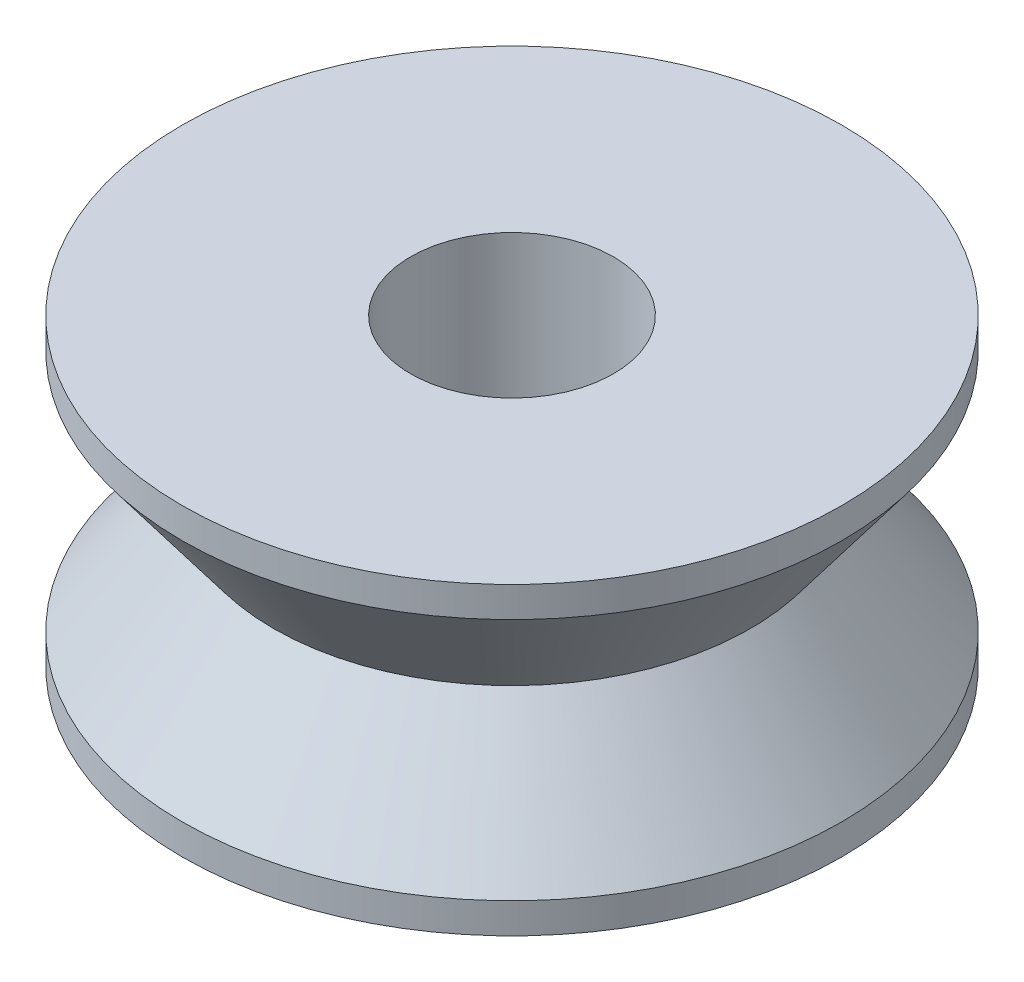
ISO-10303-21;
HEADER;
FILE_DESCRIPTION(('STEP AP214'),'2;1');
FILE_NAME('part.step','',(''),(''),'','','');
FILE_SCHEMA(('AUTOMOTIVE_DESIGN { 1 0 10303 214 1 1 1 1 }'));
ENDSEC;
DATA;
#1=APPLICATION_CONTEXT('core data for automotive mechanical design processes');
#2=APPLICATION_PROTOCOL_DEFINITION('international standard','automotive_design',2000,#1);
#3=PRODUCT_CONTEXT('',#1,'mechanical');
#4=PRODUCT('Part','Part','',(#3));
#5=PRODUCT_RELATED_PRODUCT_CATEGORY('part','',(#4));
#6=PRODUCT_DEFINITION_FORMATION('','',#4);
#7=PRODUCT_DEFINITION_CONTEXT('part definition',#1,'design');
#8=PRODUCT_DEFINITION('design','',#6,#7);
#9=PRODUCT_DEFINITION_SHAPE('','',#8);
#10=(LENGTH_UNIT() NAMED_UNIT(*) SI_UNIT(.MILLI.,.METRE.));
#11=(NAMED_UNIT(*) PLANE_ANGLE_UNIT() SI_UNIT($,.RADIAN.));
#12=(NAMED_UNIT(*) SI_UNIT($,.STERADIAN.) SOLID_ANGLE_UNIT());
#13=UNCERTAINTY_MEASURE_WITH_UNIT(LENGTH_MEASURE(1.E-05),#10,'distance_accuracy_value','');
#14=(GEOMETRIC_REPRESENTATION_CONTEXT(3) GLOBAL_UNCERTAINTY_ASSIGNED_CONTEXT((#13)) GLOBAL_UNIT_ASSIGNED_CONTEXT((#10,
#11,#12)) REPRESENTATION_CONTEXT('',''));
#15=CARTESIAN_POINT('',(0.,0.,0.));
#16=DIRECTION('',(0.,0.,1.));
#17=DIRECTION('',(1.,0.,0.));
#18=AXIS2_PLACEMENT_3D('',#15,#16,#17);
#19=CARTESIAN_POINT('',(-2.,3.,0.));
#20=DIRECTION('',(0.,-1.,0.));
#21=DIRECTION('',(0.,0.,-1.));
#22=AXIS2_PLACEMENT_3D('',#19,#20,#21);
#23=PLANE('',#22);
#24=CARTESIAN_POINT('',(0.,3.,0.));
#25=DIRECTION('',(0.,-1.,0.));
#26=DIRECTION('',(0.,0.,-1.));
#27=AXIS2_PLACEMENT_3D('',#24,#25,#26);
#28=CIRCLE('',#27,6.5);
#29=CARTESIAN_POINT('',(0.,3.,-6.5));
#30=VERTEX_POINT('',#29);
#31=EDGE_CURVE('E10',#30,#30,#28,.T.);
#32=ORIENTED_EDGE('',*,*,#31,.F.);
#33=EDGE_LOOP('',(#32));
#34=FACE_BOUND('',#33,.T.);
#35=CARTESIAN_POINT('',(0.,3.,0.));
#36=DIRECTION('',(0.,-1.,0.));
#37=DIRECTION('',(0.,0.,-1.));
#38=AXIS2_PLACEMENT_3D('',#35,#36,#37);
#39=CIRCLE('',#38,2.);
#40=CARTESIAN_POINT('',(0.,3.,-2.));
#41=VERTEX_POINT('',#40);
#42=EDGE_CURVE('E62',#41,#41,#39,.T.);
#43=ORIENTED_EDGE('',*,*,#42,.T.);
#44=EDGE_LOOP('',(#43));
#45=FACE_BOUND('',#44,.T.);
#46=ADVANCED_FACE('F37',(#34,#45),#23,.F.);
#47=CARTESIAN_POINT('',(0.,0.,0.));
#48=DIRECTION('',(0.,-1.,0.));
#49=DIRECTION('',(0.,0.,-1.));
#50=AXIS2_PLACEMENT_3D('',#47,#48,#49);
#51=CYLINDRICAL_SURFACE('',#50,6.5);
#52=CARTESIAN_POINT('',(0.,2.4,0.));
#53=DIRECTION('',(0.,-1.,0.));
#54=DIRECTION('',(0.,0.,-1.));
#55=AXIS2_PLACEMENT_3D('',#52,#53,#54);
#56=CIRCLE('',#55,6.5);
#57=CARTESIAN_POINT('',(0.,2.4,-6.5));
#58=VERTEX_POINT('',#57);
#59=EDGE_CURVE('E43',#58,#58,#56,.T.);
#60=ORIENTED_EDGE('',*,*,#59,.F.);
#61=EDGE_LOOP('',(#60));
#62=FACE_BOUND('',#61,.T.);
#63=ORIENTED_EDGE('',*,*,#31,.T.);
#64=EDGE_LOOP('',(#63));
#65=FACE_BOUND('',#64,.T.);
#66=ADVANCED_FACE('F93',(#62,#65),#51,.T.);
#67=CARTESIAN_POINT('',(0.,2.4,0.));
#68=DIRECTION('',(0.,1.,0.));
#69=DIRECTION('',(0.,0.,1.));
#70=AXIS2_PLACEMENT_3D('',#67,#68,#69);
#71=CONICAL_SURFACE('',#70,6.5,0.643501108793285);
#72=CARTESIAN_POINT('',(0.,0.,0.));
#73=DIRECTION('',(0.,-1.,0.));
#74=DIRECTION('',(0.,0.,-1.));
#75=AXIS2_PLACEMENT_3D('',#72,#73,#74);
#76=CIRCLE('',#75,4.7);
#77=CARTESIAN_POINT('',(0.,0.,-4.7));
#78=VERTEX_POINT('',#77);
#79=EDGE_CURVE('E47',#78,#78,#76,.T.);
#80=ORIENTED_EDGE('',*,*,#79,.F.);
#81=EDGE_LOOP('',(#80));
#82=FACE_BOUND('',#81,.T.);
#83=ORIENTED_EDGE('',*,*,#59,.T.);
#84=EDGE_LOOP('',(#83));
#85=FACE_BOUND('',#84,.T.);
#86=ADVANCED_FACE('F88',(#82,#85),#71,.T.);
#87=CARTESIAN_POINT('',(0.,0.,0.));
#88=DIRECTION('',(0.,-1.,0.));
#89=DIRECTION('',(0.,0.,-1.));
#90=AXIS2_PLACEMENT_3D('',#87,#88,#89);
#91=CONICAL_SURFACE('',#90,4.7,0.643501108793285);
#92=CARTESIAN_POINT('',(0.,-2.4,0.));
#93=DIRECTION('',(0.,-1.,0.));
#94=DIRECTION('',(0.,0.,-1.));
#95=AXIS2_PLACEMENT_3D('',#92,#93,#94);
#96=CIRCLE('',#95,6.5);
#97=CARTESIAN_POINT('',(0.,-2.4,-6.5));
#98=VERTEX_POINT('',#97);
#99=EDGE_CURVE('E51',#98,#98,#96,.T.);
#100=ORIENTED_EDGE('',*,*,#99,.F.);
#101=EDGE_LOOP('',(#100));
#102=FACE_BOUND('',#101,.T.);
#103=ORIENTED_EDGE('',*,*,#79,.T.);
#104=EDGE_LOOP('',(#103));
#105=FACE_BOUND('',#104,.T.);
#106=ADVANCED_FACE('F82',(#102,#105),#91,.T.);
#107=CARTESIAN_POINT('',(0.,0.,0.));
#108=DIRECTION('',(0.,-1.,0.));
#109=DIRECTION('',(0.,0.,-1.));
#110=AXIS2_PLACEMENT_3D('',#107,#108,#109);
#111=CYLINDRICAL_SURFACE('',#110,6.5);
#112=CARTESIAN_POINT('',(0.,-3.,0.));
#113=DIRECTION('',(0.,-1.,0.));
#114=DIRECTION('',(0.,0.,-1.));
#115=AXIS2_PLACEMENT_3D('',#112,#113,#114);
#116=CIRCLE('',#115,6.5);
#117=CARTESIAN_POINT('',(0.,-3.,-6.5));
#118=VERTEX_POINT('',#117);
#119=EDGE_CURVE('E56',#118,#118,#116,.T.);
#120=ORIENTED_EDGE('',*,*,#119,.F.);
#121=EDGE_LOOP('',(#120));
#122=FACE_BOUND('',#121,.T.);
#123=ORIENTED_EDGE('',*,*,#99,.T.);
#124=EDGE_LOOP('',(#123));
#125=FACE_BOUND('',#124,.T.);
#126=ADVANCED_FACE('F76',(#122,#125),#111,.T.);
#127=CARTESIAN_POINT('',(-6.5,-3.,0.));
#128=DIRECTION('',(0.,1.,0.));
#129=DIRECTION('',(0.,0.,1.));
#130=AXIS2_PLACEMENT_3D('',#127,#128,#129);
#131=PLANE('',#130);
#132=CARTESIAN_POINT('',(0.,-3.,0.));
#133=DIRECTION('',(0.,-1.,0.));
#134=DIRECTION('',(0.,0.,-1.));
#135=AXIS2_PLACEMENT_3D('',#132,#133,#134);
#136=CIRCLE('',#135,2.);
#137=CARTESIAN_POINT('',(0.,-3.,-2.));
#138=VERTEX_POINT('',#137);
#139=EDGE_CURVE('E59',#138,#138,#136,.T.);
#140=ORIENTED_EDGE('',*,*,#139,.F.);
#141=EDGE_LOOP('',(#140));
#142=FACE_BOUND('',#141,.T.);
#143=ORIENTED_EDGE('',*,*,#119,.T.);
#144=EDGE_LOOP('',(#143));
#145=FACE_BOUND('',#144,.T.);
#146=ADVANCED_FACE('F70',(#142,#145),#131,.F.);
#147=CARTESIAN_POINT('',(0.,0.,0.));
#148=DIRECTION('',(0.,-1.,0.));
#149=DIRECTION('',(0.,0.,-1.));
#150=AXIS2_PLACEMENT_3D('',#147,#148,#149);
#151=CYLINDRICAL_SURFACE('',#150,2.);
#152=ORIENTED_EDGE('',*,*,#42,.F.);
#153=EDGE_LOOP('',(#152));
#154=FACE_BOUND('',#153,.T.);
#155=ORIENTED_EDGE('',*,*,#139,.T.);
#156=EDGE_LOOP('',(#155));
#157=FACE_BOUND('',#156,.T.);
#158=ADVANCED_FACE('F67',(#154,#157),#151,.F.);
#159=CLOSED_SHELL('',(#46,#66,#86,#106,#126,#146,#158));
#160=MANIFOLD_SOLID_BREP('B2',#159);
#161=ADVANCED_BREP_SHAPE_REPRESENTATION('',(#18,#160),#14);
#162=SHAPE_DEFINITION_REPRESENTATION(#9,#161);
ENDSEC;
END-ISO-10303-21;
